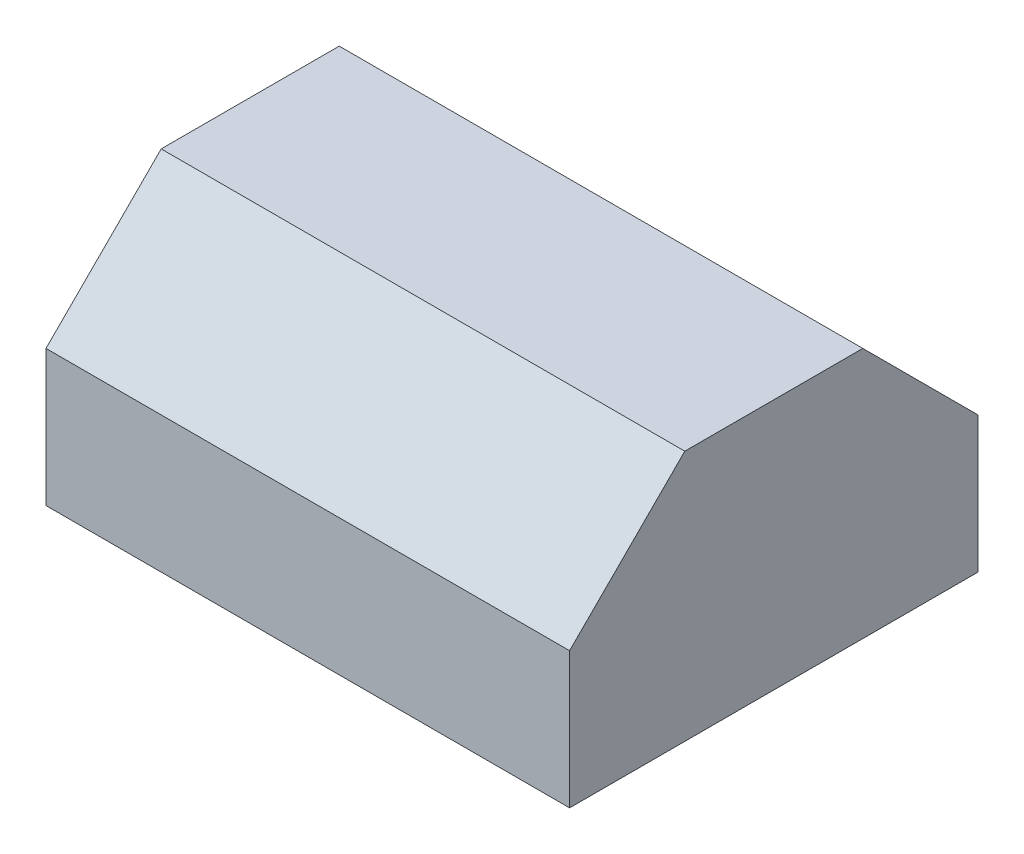
ISO-10303-21;
HEADER;
FILE_DESCRIPTION(('STEP AP214'),'2;1');
FILE_NAME('part.step','',(''),(''),'','','');
FILE_SCHEMA(('AUTOMOTIVE_DESIGN { 1 0 10303 214 1 1 1 1 }'));
ENDSEC;
DATA;
#1=APPLICATION_CONTEXT('core data for automotive mechanical design processes');
#2=APPLICATION_PROTOCOL_DEFINITION('international standard','automotive_design',2000,#1);
#3=PRODUCT_CONTEXT('',#1,'mechanical');
#4=PRODUCT('Part','Part','',(#3));
#5=PRODUCT_RELATED_PRODUCT_CATEGORY('part','',(#4));
#6=PRODUCT_DEFINITION_FORMATION('','',#4);
#7=PRODUCT_DEFINITION_CONTEXT('part definition',#1,'design');
#8=PRODUCT_DEFINITION('design','',#6,#7);
#9=PRODUCT_DEFINITION_SHAPE('','',#8);
#10=(LENGTH_UNIT() NAMED_UNIT(*) SI_UNIT(.MILLI.,.METRE.));
#11=(NAMED_UNIT(*) PLANE_ANGLE_UNIT() SI_UNIT($,.RADIAN.));
#12=(NAMED_UNIT(*) SI_UNIT($,.STERADIAN.) SOLID_ANGLE_UNIT());
#13=UNCERTAINTY_MEASURE_WITH_UNIT(LENGTH_MEASURE(1.E-05),#10,'distance_accuracy_value','');
#14=(GEOMETRIC_REPRESENTATION_CONTEXT(3) GLOBAL_UNCERTAINTY_ASSIGNED_CONTEXT((#13)) GLOBAL_UNIT_ASSIGNED_CONTEXT((#10,
#11,#12)) REPRESENTATION_CONTEXT('',''));
#15=CARTESIAN_POINT('',(0.,0.,0.));
#16=DIRECTION('',(0.,0.,1.));
#17=DIRECTION('',(1.,0.,0.));
#18=AXIS2_PLACEMENT_3D('',#15,#16,#17);
#19=CARTESIAN_POINT('',(250.,0.,0.));
#20=DIRECTION('',(0.,1.,0.));
#21=DIRECTION('',(0.,0.,1.));
#22=AXIS2_PLACEMENT_3D('',#19,#20,#21);
#23=PLANE('',#22);
#24=DIRECTION('',(0.,0.,-1.));
#25=VECTOR('',#24,1.);
#26=CARTESIAN_POINT('',(230.,0.,-195.));
#27=LINE('',#26,#25);
#28=CARTESIAN_POINT('',(230.,0.,-190.));
#29=VERTEX_POINT('',#28);
#30=CARTESIAN_POINT('',(230.,0.,-195.));
#31=VERTEX_POINT('',#30);
#32=EDGE_CURVE('E201',#29,#31,#27,.T.);
#33=ORIENTED_EDGE('',*,*,#32,.F.);
#34=DIRECTION('',(-1.,0.,0.));
#35=VECTOR('',#34,1.);
#36=CARTESIAN_POINT('',(250.,0.,-190.));
#37=LINE('',#36,#35);
#38=CARTESIAN_POINT('',(20.,0.,-190.));
#39=VERTEX_POINT('',#38);
#40=EDGE_CURVE('E210',#29,#39,#37,.T.);
#41=ORIENTED_EDGE('',*,*,#40,.T.);
#42=DIRECTION('',(0.,0.,1.));
#43=VECTOR('',#42,1.);
#44=CARTESIAN_POINT('',(20.,0.,-195.));
#45=LINE('',#44,#43);
#46=CARTESIAN_POINT('',(20.,0.,-195.));
#47=VERTEX_POINT('',#46);
#48=EDGE_CURVE('E244',#47,#39,#45,.T.);
#49=ORIENTED_EDGE('',*,*,#48,.F.);
#50=DIRECTION('',(-1.,0.,0.));
#51=VECTOR('',#50,1.);
#52=CARTESIAN_POINT('',(250.,0.,-195.));
#53=LINE('',#52,#51);
#54=EDGE_CURVE('E221',#31,#47,#53,.T.);
#55=ORIENTED_EDGE('',*,*,#54,.F.);
#56=EDGE_LOOP('',(#33,#41,#49,#55));
#57=FACE_BOUND('',#56,.T.);
#58=ADVANCED_FACE('F35',(#57),#23,.F.);
#59=DIRECTION('',(0.,0.,1.));
#60=VECTOR('',#59,1.);
#61=CARTESIAN_POINT('',(240.,0.,-195.));
#62=LINE('',#61,#60);
#63=CARTESIAN_POINT('',(240.,0.,-195.));
#64=VERTEX_POINT('',#63);
#65=CARTESIAN_POINT('',(240.,0.,-190.));
#66=VERTEX_POINT('',#65);
#67=EDGE_CURVE('E222',#64,#66,#62,.T.);
#68=ORIENTED_EDGE('',*,*,#67,.F.);
#69=CARTESIAN_POINT('',(250.,0.,-195.));
#70=VERTEX_POINT('',#69);
#71=EDGE_CURVE('E385',#70,#64,#53,.T.);
#72=ORIENTED_EDGE('',*,*,#71,.F.);
#73=DIRECTION('',(0.,0.,-1.));
#74=VECTOR('',#73,1.);
#75=CARTESIAN_POINT('',(250.,0.,0.));
#76=LINE('',#75,#74);
#77=CARTESIAN_POINT('',(250.,0.,0.));
#78=VERTEX_POINT('',#77);
#79=EDGE_CURVE('E346',#78,#70,#76,.T.);
#80=ORIENTED_EDGE('',*,*,#79,.F.);
#81=DIRECTION('',(-1.,0.,0.));
#82=VECTOR('',#81,1.);
#83=CARTESIAN_POINT('',(250.,0.,0.));
#84=LINE('',#83,#82);
#85=CARTESIAN_POINT('',(0.,0.,0.));
#86=VERTEX_POINT('',#85);
#87=EDGE_CURVE('E380',#78,#86,#84,.T.);
#88=ORIENTED_EDGE('',*,*,#87,.T.);
#89=DIRECTION('',(0.,0.,-1.));
#90=VECTOR('',#89,1.);
#91=CARTESIAN_POINT('',(0.,0.,0.));
#92=LINE('',#91,#90);
#93=CARTESIAN_POINT('',(0.,0.,-195.));
#94=VERTEX_POINT('',#93);
#95=EDGE_CURVE('E361',#86,#94,#92,.T.);
#96=ORIENTED_EDGE('',*,*,#95,.T.);
#97=CARTESIAN_POINT('',(10.,0.,-195.));
#98=VERTEX_POINT('',#97);
#99=EDGE_CURVE('E377',#98,#94,#53,.T.);
#100=ORIENTED_EDGE('',*,*,#99,.F.);
#101=DIRECTION('',(0.,0.,-1.));
#102=VECTOR('',#101,1.);
#103=CARTESIAN_POINT('',(10.,0.,-195.));
#104=LINE('',#103,#102);
#105=CARTESIAN_POINT('',(10.,0.,-190.));
#106=VERTEX_POINT('',#105);
#107=EDGE_CURVE('E239',#106,#98,#104,.T.);
#108=ORIENTED_EDGE('',*,*,#107,.F.);
#109=CARTESIAN_POINT('',(5.,0.,-190.));
#110=VERTEX_POINT('',#109);
#111=EDGE_CURVE('E217',#106,#110,#37,.T.);
#112=ORIENTED_EDGE('',*,*,#111,.T.);
#113=DIRECTION('',(0.,0.,-1.));
#114=VECTOR('',#113,1.);
#115=CARTESIAN_POINT('',(5.,0.,0.));
#116=LINE('',#115,#114);
#117=CARTESIAN_POINT('',(5.,0.,-5.));
#118=VERTEX_POINT('',#117);
#119=EDGE_CURVE('E331',#118,#110,#116,.T.);
#120=ORIENTED_EDGE('',*,*,#119,.F.);
#121=DIRECTION('',(-1.,0.,0.));
#122=VECTOR('',#121,1.);
#123=CARTESIAN_POINT('',(250.,0.,-5.));
#124=LINE('',#123,#122);
#125=CARTESIAN_POINT('',(245.,0.,-5.));
#126=VERTEX_POINT('',#125);
#127=EDGE_CURVE('E722',#126,#118,#124,.T.);
#128=ORIENTED_EDGE('',*,*,#127,.F.);
#129=DIRECTION('',(0.,0.,-1.));
#130=VECTOR('',#129,1.);
#131=CARTESIAN_POINT('',(245.,0.,0.));
#132=LINE('',#131,#130);
#133=CARTESIAN_POINT('',(245.,0.,-190.));
#134=VERTEX_POINT('',#133);
#135=EDGE_CURVE('E333',#126,#134,#132,.T.);
#136=ORIENTED_EDGE('',*,*,#135,.T.);
#137=EDGE_CURVE('E216',#134,#66,#37,.T.);
#138=ORIENTED_EDGE('',*,*,#137,.T.);
#139=EDGE_LOOP('',(#68,#72,#80,#88,#96,#100,#108,#112,#120,#128,#136,#138));
#140=FACE_BOUND('',#139,.T.);
#141=ADVANCED_FACE('F400',(#140),#23,.F.);
#142=CARTESIAN_POINT('',(250.,32.5000000000002,32.5));
#143=DIRECTION('',(0.,-0.70710678118655,-0.707106781186545));
#144=DIRECTION('',(0.,0.707106781186545,-0.70710678118655));
#145=AXIS2_PLACEMENT_3D('',#142,#143,#144);
#146=PLANE('',#145);
#147=DIRECTION('',(0.,-0.707106781186545,0.70710678118655));
#148=VECTOR('',#147,1.);
#149=CARTESIAN_POINT('',(0.,32.5000000000002,32.5));
#150=LINE('',#149,#148);
#151=CARTESIAN_POINT('',(0.,120.,-55.0000000000001));
#152=VERTEX_POINT('',#151);
#153=CARTESIAN_POINT('',(0.,65.,0.));
#154=VERTEX_POINT('',#153);
#155=EDGE_CURVE('E355',#152,#154,#150,.T.);
#156=ORIENTED_EDGE('',*,*,#155,.T.);
#157=DIRECTION('',(-1.,0.,0.));
#158=VECTOR('',#157,1.);
#159=CARTESIAN_POINT('',(250.,65.,0.));
#160=LINE('',#159,#158);
#161=CARTESIAN_POINT('',(250.,65.,0.));
#162=VERTEX_POINT('',#161);
#163=EDGE_CURVE('E387',#162,#154,#160,.T.);
#164=ORIENTED_EDGE('',*,*,#163,.F.);
#165=DIRECTION('',(0.,-0.707106781186545,0.70710678118655));
#166=VECTOR('',#165,1.);
#167=CARTESIAN_POINT('',(250.,32.5000000000002,32.5));
#168=LINE('',#167,#166);
#169=CARTESIAN_POINT('',(250.,120.,-55.0000000000001));
#170=VERTEX_POINT('',#169);
#171=EDGE_CURVE('E340',#170,#162,#168,.T.);
#172=ORIENTED_EDGE('',*,*,#171,.F.);
#173=DIRECTION('',(-1.,0.,0.));
#174=VECTOR('',#173,1.);
#175=CARTESIAN_POINT('',(250.,120.,-55.0000000000001));
#176=LINE('',#175,#174);
#177=EDGE_CURVE('E354',#170,#152,#176,.T.);
#178=ORIENTED_EDGE('',*,*,#177,.T.);
#179=EDGE_LOOP('',(#156,#164,#172,#178));
#180=FACE_BOUND('',#179,.T.);
#181=ADVANCED_FACE('F454',(#180),#146,.F.);
#182=CARTESIAN_POINT('',(250.,0.,0.));
#183=DIRECTION('',(0.,0.,-1.));
#184=DIRECTION('',(0.,1.,0.));
#185=AXIS2_PLACEMENT_3D('',#182,#183,#184);
#186=PLANE('',#185);
#187=DIRECTION('',(0.,-1.,0.));
#188=VECTOR('',#187,1.);
#189=CARTESIAN_POINT('',(0.,0.,0.));
#190=LINE('',#189,#188);
#191=EDGE_CURVE('E358',#154,#86,#190,.T.);
#192=ORIENTED_EDGE('',*,*,#191,.T.);
#193=ORIENTED_EDGE('',*,*,#87,.F.);
#194=DIRECTION('',(0.,-1.,0.));
#195=VECTOR('',#194,1.);
#196=CARTESIAN_POINT('',(250.,0.,0.));
#197=LINE('',#196,#195);
#198=EDGE_CURVE('E343',#162,#78,#197,.T.);
#199=ORIENTED_EDGE('',*,*,#198,.F.);
#200=ORIENTED_EDGE('',*,*,#163,.T.);
#201=EDGE_LOOP('',(#192,#193,#199,#200));
#202=FACE_BOUND('',#201,.T.);
#203=ADVANCED_FACE('F458',(#202),#186,.F.);
#204=CARTESIAN_POINT('',(250.,0.,-195.));
#205=DIRECTION('',(0.,0.,1.));
#206=DIRECTION('',(1.,0.,0.));
#207=AXIS2_PLACEMENT_3D('',#204,#205,#206);
#208=PLANE('',#207);
#209=DIRECTION('',(0.,1.,0.));
#210=VECTOR('',#209,1.);
#211=CARTESIAN_POINT('',(240.,-5.,-195.));
#212=LINE('',#211,#210);
#213=CARTESIAN_POINT('',(240.,-3.,-195.));
#214=VERTEX_POINT('',#213);
#215=EDGE_CURVE('E235',#214,#64,#212,.T.);
#216=ORIENTED_EDGE('',*,*,#215,.F.);
#217=DIRECTION('',(1.,0.,0.));
#218=VECTOR('',#217,1.);
#219=CARTESIAN_POINT('',(250.,-3.,-195.));
#220=LINE('',#219,#218);
#221=CARTESIAN_POINT('',(230.,-3.,-195.));
#222=VERTEX_POINT('',#221);
#223=EDGE_CURVE('E284',#214,#222,#220,.F.);
#224=ORIENTED_EDGE('',*,*,#223,.T.);
#225=DIRECTION('',(0.,1.,0.));
#226=VECTOR('',#225,1.);
#227=CARTESIAN_POINT('',(230.,-5.,-195.));
#228=LINE('',#227,#226);
#229=EDGE_CURVE('E237',#222,#31,#228,.T.);
#230=ORIENTED_EDGE('',*,*,#229,.T.);
#231=ORIENTED_EDGE('',*,*,#54,.T.);
#232=DIRECTION('',(0.,1.,0.));
#233=VECTOR('',#232,1.);
#234=CARTESIAN_POINT('',(20.,-5.,-195.));
#235=LINE('',#234,#233);
#236=CARTESIAN_POINT('',(20.,-3.,-195.));
#237=VERTEX_POINT('',#236);
#238=EDGE_CURVE('E267',#237,#47,#235,.T.);
#239=ORIENTED_EDGE('',*,*,#238,.F.);
#240=DIRECTION('',(1.,0.,0.));
#241=VECTOR('',#240,1.);
#242=CARTESIAN_POINT('',(250.,-3.,-195.));
#243=LINE('',#242,#241);
#244=CARTESIAN_POINT('',(10.,-3.,-195.));
#245=VERTEX_POINT('',#244);
#246=EDGE_CURVE('E282',#237,#245,#243,.F.);
#247=ORIENTED_EDGE('',*,*,#246,.T.);
#248=DIRECTION('',(0.,1.,0.));
#249=VECTOR('',#248,1.);
#250=CARTESIAN_POINT('',(10.,-5.,-195.));
#251=LINE('',#250,#249);
#252=EDGE_CURVE('E277',#245,#98,#251,.T.);
#253=ORIENTED_EDGE('',*,*,#252,.T.);
#254=ORIENTED_EDGE('',*,*,#99,.T.);
#255=DIRECTION('',(0.,1.,0.));
#256=VECTOR('',#255,1.);
#257=CARTESIAN_POINT('',(0.,0.,-195.));
#258=LINE('',#257,#256);
#259=CARTESIAN_POINT('',(0.,65.,-195.));
#260=VERTEX_POINT('',#259);
#261=EDGE_CURVE('E364',#94,#260,#258,.T.);
#262=ORIENTED_EDGE('',*,*,#261,.T.);
#263=DIRECTION('',(-1.,0.,0.));
#264=VECTOR('',#263,1.);
#265=CARTESIAN_POINT('',(250.,65.,-195.));
#266=LINE('',#265,#264);
#267=CARTESIAN_POINT('',(250.,65.,-195.));
#268=VERTEX_POINT('',#267);
#269=EDGE_CURVE('E374',#268,#260,#266,.T.);
#270=ORIENTED_EDGE('',*,*,#269,.F.);
#271=DIRECTION('',(0.,1.,0.));
#272=VECTOR('',#271,1.);
#273=CARTESIAN_POINT('',(250.,0.,-195.));
#274=LINE('',#273,#272);
#275=EDGE_CURVE('E348',#70,#268,#274,.T.);
#276=ORIENTED_EDGE('',*,*,#275,.F.);
#277=ORIENTED_EDGE('',*,*,#71,.T.);
#278=EDGE_LOOP('',(#216,#224,#230,#231,#239,#247,#253,#254,#262,#270,#276,#277));
#279=FACE_BOUND('',#278,.T.);
#280=ADVANCED_FACE('F304',(#279),#208,.F.);
#281=CARTESIAN_POINT('',(250.,130.,-130.));
#282=DIRECTION('',(0.,-0.707106781186549,0.707106781186546));
#283=DIRECTION('',(0.,-0.707106781186546,-0.707106781186549));
#284=AXIS2_PLACEMENT_3D('',#281,#282,#283);
#285=PLANE('',#284);
#286=DIRECTION('',(0.,0.707106781186546,0.707106781186549));
#287=VECTOR('',#286,1.);
#288=CARTESIAN_POINT('',(0.,130.,-130.));
#289=LINE('',#288,#287);
#290=CARTESIAN_POINT('',(0.,120.,-140.));
#291=VERTEX_POINT('',#290);
#292=EDGE_CURVE('E366',#260,#291,#289,.T.);
#293=ORIENTED_EDGE('',*,*,#292,.T.);
#294=DIRECTION('',(-1.,0.,0.));
#295=VECTOR('',#294,1.);
#296=CARTESIAN_POINT('',(250.,120.,-140.));
#297=LINE('',#296,#295);
#298=CARTESIAN_POINT('',(250.,120.,-140.));
#299=VERTEX_POINT('',#298);
#300=EDGE_CURVE('E371',#299,#291,#297,.T.);
#301=ORIENTED_EDGE('',*,*,#300,.F.);
#302=DIRECTION('',(0.,0.707106781186546,0.707106781186549));
#303=VECTOR('',#302,1.);
#304=CARTESIAN_POINT('',(250.,130.,-130.));
#305=LINE('',#304,#303);
#306=EDGE_CURVE('E350',#268,#299,#305,.T.);
#307=ORIENTED_EDGE('',*,*,#306,.F.);
#308=ORIENTED_EDGE('',*,*,#269,.T.);
#309=EDGE_LOOP('',(#293,#301,#307,#308));
#310=FACE_BOUND('',#309,.T.);
#311=ADVANCED_FACE('F413',(#310),#285,.F.);
#312=CARTESIAN_POINT('',(250.,120.,1.17553026136781E-13));
#313=DIRECTION('',(0.,-1.,0.));
#314=DIRECTION('',(0.,0.,-1.));
#315=AXIS2_PLACEMENT_3D('',#312,#313,#314);
#316=PLANE('',#315);
#317=DIRECTION('',(0.,0.,1.));
#318=VECTOR('',#317,1.);
#319=CARTESIAN_POINT('',(0.,120.,1.17553026136781E-13));
#320=LINE('',#319,#318);
#321=EDGE_CURVE('E344',#291,#152,#320,.T.);
#322=ORIENTED_EDGE('',*,*,#321,.T.);
#323=ORIENTED_EDGE('',*,*,#177,.F.);
#324=DIRECTION('',(0.,0.,1.));
#325=VECTOR('',#324,1.);
#326=CARTESIAN_POINT('',(250.,120.,1.17553026136781E-13));
#327=LINE('',#326,#325);
#328=EDGE_CURVE('E352',#299,#170,#327,.T.);
#329=ORIENTED_EDGE('',*,*,#328,.F.);
#330=ORIENTED_EDGE('',*,*,#300,.T.);
#331=EDGE_LOOP('',(#322,#323,#329,#330));
#332=FACE_BOUND('',#331,.T.);
#333=ADVANCED_FACE('F466',(#332),#316,.F.);
#334=CARTESIAN_POINT('',(250.,0.,0.));
#335=DIRECTION('',(1.,0.,0.));
#336=DIRECTION('',(0.,0.,-1.));
#337=AXIS2_PLACEMENT_3D('',#334,#335,#336);
#338=PLANE('',#337);
#339=ORIENTED_EDGE('',*,*,#171,.T.);
#340=ORIENTED_EDGE('',*,*,#198,.T.);
#341=ORIENTED_EDGE('',*,*,#79,.T.);
#342=ORIENTED_EDGE('',*,*,#275,.T.);
#343=ORIENTED_EDGE('',*,*,#306,.T.);
#344=ORIENTED_EDGE('',*,*,#328,.T.);
#345=EDGE_LOOP('',(#339,#340,#341,#342,#343,#344));
#346=FACE_BOUND('',#345,.T.);
#347=ADVANCED_FACE('F417',(#346),#338,.T.);
#348=CARTESIAN_POINT('',(0.,0.,0.));
#349=DIRECTION('',(1.,0.,0.));
#350=DIRECTION('',(0.,0.,-1.));
#351=AXIS2_PLACEMENT_3D('',#348,#349,#350);
#352=PLANE('',#351);
#353=ORIENTED_EDGE('',*,*,#155,.F.);
#354=ORIENTED_EDGE('',*,*,#321,.F.);
#355=ORIENTED_EDGE('',*,*,#292,.F.);
#356=ORIENTED_EDGE('',*,*,#261,.F.);
#357=ORIENTED_EDGE('',*,*,#95,.F.);
#358=ORIENTED_EDGE('',*,*,#191,.F.);
#359=EDGE_LOOP('',(#353,#354,#355,#356,#357,#358));
#360=FACE_BOUND('',#359,.T.);
#361=ADVANCED_FACE('F406',(#360),#352,.F.);
#362=CARTESIAN_POINT('',(250.,28.9644660940675,28.9644660940673));
#363=DIRECTION('',(0.,-0.70710678118655,-0.707106781186545));
#364=DIRECTION('',(0.,0.707106781186545,-0.70710678118655));
#365=AXIS2_PLACEMENT_3D('',#362,#363,#364);
#366=PLANE('',#365);
#367=DIRECTION('',(0.,-0.707106781186545,0.70710678118655));
#368=VECTOR('',#367,1.);
#369=CARTESIAN_POINT('',(5.,28.9644660940675,28.9644660940673));
#370=LINE('',#369,#368);
#371=CARTESIAN_POINT('',(5.,115.,-57.0710678118655));
#372=VERTEX_POINT('',#371);
#373=CARTESIAN_POINT('',(5.,62.9289321881345,-5.));
#374=VERTEX_POINT('',#373);
#375=EDGE_CURVE('E281',#372,#374,#370,.T.);
#376=ORIENTED_EDGE('',*,*,#375,.F.);
#377=DIRECTION('',(-1.,0.,0.));
#378=VECTOR('',#377,1.);
#379=CARTESIAN_POINT('',(250.,115.,-57.0710678118655));
#380=LINE('',#379,#378);
#381=CARTESIAN_POINT('',(245.,115.,-57.0710678118655));
#382=VERTEX_POINT('',#381);
#383=EDGE_CURVE('E715',#382,#372,#380,.T.);
#384=ORIENTED_EDGE('',*,*,#383,.F.);
#385=DIRECTION('',(0.,-0.707106781186545,0.70710678118655));
#386=VECTOR('',#385,1.);
#387=CARTESIAN_POINT('',(245.,28.9644660940675,28.9644660940673));
#388=LINE('',#387,#386);
#389=CARTESIAN_POINT('',(245.,62.9289321881345,-5.));
#390=VERTEX_POINT('',#389);
#391=EDGE_CURVE('E723',#382,#390,#388,.T.);
#392=ORIENTED_EDGE('',*,*,#391,.T.);
#393=DIRECTION('',(-1.,0.,0.));
#394=VECTOR('',#393,1.);
#395=CARTESIAN_POINT('',(250.,62.9289321881345,-5.));
#396=LINE('',#395,#394);
#397=EDGE_CURVE('E359',#390,#374,#396,.T.);
#398=ORIENTED_EDGE('',*,*,#397,.T.);
#399=EDGE_LOOP('',(#376,#384,#392,#398));
#400=FACE_BOUND('',#399,.T.);
#401=ADVANCED_FACE('F476',(#400),#366,.T.);
#402=CARTESIAN_POINT('',(250.,0.,-5.));
#403=DIRECTION('',(0.,0.,-1.));
#404=DIRECTION('',(0.,1.,0.));
#405=AXIS2_PLACEMENT_3D('',#402,#403,#404);
#406=PLANE('',#405);
#407=DIRECTION('',(0.,-1.,0.));
#408=VECTOR('',#407,1.);
#409=CARTESIAN_POINT('',(5.,0.,-5.));
#410=LINE('',#409,#408);
#411=EDGE_CURVE('E718',#374,#118,#410,.T.);
#412=ORIENTED_EDGE('',*,*,#411,.F.);
#413=ORIENTED_EDGE('',*,*,#397,.F.);
#414=DIRECTION('',(0.,-1.,0.));
#415=VECTOR('',#414,1.);
#416=CARTESIAN_POINT('',(245.,0.,-5.));
#417=LINE('',#416,#415);
#418=EDGE_CURVE('E339',#390,#126,#417,.T.);
#419=ORIENTED_EDGE('',*,*,#418,.T.);
#420=ORIENTED_EDGE('',*,*,#127,.T.);
#421=EDGE_LOOP('',(#412,#413,#419,#420));
#422=FACE_BOUND('',#421,.T.);
#423=ADVANCED_FACE('F496',(#422),#406,.T.);
#424=CARTESIAN_POINT('',(250.,0.,-190.));
#425=DIRECTION('',(0.,0.,1.));
#426=DIRECTION('',(1.,0.,0.));
#427=AXIS2_PLACEMENT_3D('',#424,#425,#426);
#428=PLANE('',#427);
#429=DIRECTION('',(0.,1.,0.));
#430=VECTOR('',#429,1.);
#431=CARTESIAN_POINT('',(230.,-5.,-190.));
#432=LINE('',#431,#430);
#433=CARTESIAN_POINT('',(230.,-3.,-190.));
#434=VERTEX_POINT('',#433);
#435=EDGE_CURVE('E196',#434,#29,#432,.T.);
#436=ORIENTED_EDGE('',*,*,#435,.F.);
#437=DIRECTION('',(-1.,0.,0.));
#438=VECTOR('',#437,1.);
#439=CARTESIAN_POINT('',(240.,-3.,-190.));
#440=LINE('',#439,#438);
#441=CARTESIAN_POINT('',(240.,-3.,-190.));
#442=VERTEX_POINT('',#441);
#443=EDGE_CURVE('E287',#434,#442,#440,.F.);
#444=ORIENTED_EDGE('',*,*,#443,.T.);
#445=DIRECTION('',(0.,1.,0.));
#446=VECTOR('',#445,1.);
#447=CARTESIAN_POINT('',(240.,-5.,-190.));
#448=LINE('',#447,#446);
#449=EDGE_CURVE('E206',#442,#66,#448,.T.);
#450=ORIENTED_EDGE('',*,*,#449,.T.);
#451=ORIENTED_EDGE('',*,*,#137,.F.);
#452=DIRECTION('',(0.,1.,0.));
#453=VECTOR('',#452,1.);
#454=CARTESIAN_POINT('',(245.,0.,-190.));
#455=LINE('',#454,#453);
#456=CARTESIAN_POINT('',(245.,62.9289321881346,-190.));
#457=VERTEX_POINT('',#456);
#458=EDGE_CURVE('E338',#134,#457,#455,.T.);
#459=ORIENTED_EDGE('',*,*,#458,.T.);
#460=DIRECTION('',(-1.,0.,0.));
#461=VECTOR('',#460,1.);
#462=CARTESIAN_POINT('',(250.,62.9289321881346,-190.));
#463=LINE('',#462,#461);
#464=CARTESIAN_POINT('',(5.,62.9289321881346,-190.));
#465=VERTEX_POINT('',#464);
#466=EDGE_CURVE('E323',#457,#465,#463,.T.);
#467=ORIENTED_EDGE('',*,*,#466,.T.);
#468=DIRECTION('',(0.,1.,0.));
#469=VECTOR('',#468,1.);
#470=CARTESIAN_POINT('',(5.,0.,-190.));
#471=LINE('',#470,#469);
#472=EDGE_CURVE('E319',#110,#465,#471,.T.);
#473=ORIENTED_EDGE('',*,*,#472,.F.);
#474=ORIENTED_EDGE('',*,*,#111,.F.);
#475=DIRECTION('',(0.,1.,0.));
#476=VECTOR('',#475,1.);
#477=CARTESIAN_POINT('',(10.,-5.,-190.));
#478=LINE('',#477,#476);
#479=CARTESIAN_POINT('',(10.,-3.,-190.));
#480=VERTEX_POINT('',#479);
#481=EDGE_CURVE('E246',#480,#106,#478,.T.);
#482=ORIENTED_EDGE('',*,*,#481,.F.);
#483=DIRECTION('',(-1.,0.,0.));
#484=VECTOR('',#483,1.);
#485=CARTESIAN_POINT('',(20.,-3.,-190.));
#486=LINE('',#485,#484);
#487=CARTESIAN_POINT('',(20.,-3.,-190.));
#488=VERTEX_POINT('',#487);
#489=EDGE_CURVE('E268',#480,#488,#486,.F.);
#490=ORIENTED_EDGE('',*,*,#489,.T.);
#491=DIRECTION('',(0.,1.,0.));
#492=VECTOR('',#491,1.);
#493=CARTESIAN_POINT('',(20.,-5.,-190.));
#494=LINE('',#493,#492);
#495=EDGE_CURVE('E212',#488,#39,#494,.T.);
#496=ORIENTED_EDGE('',*,*,#495,.T.);
#497=ORIENTED_EDGE('',*,*,#40,.F.);
#498=EDGE_LOOP('',(#436,#444,#450,#451,#459,#467,#473,#474,#482,#490,#496,#497));
#499=FACE_BOUND('',#498,.T.);
#500=ADVANCED_FACE('F211',(#499),#428,.T.);
#501=CARTESIAN_POINT('',(250.,126.464466094067,-126.464466094067));
#502=DIRECTION('',(0.,-0.707106781186549,0.707106781186546));
#503=DIRECTION('',(0.,-0.707106781186546,-0.707106781186549));
#504=AXIS2_PLACEMENT_3D('',#501,#502,#503);
#505=PLANE('',#504);
#506=DIRECTION('',(0.,0.707106781186546,0.707106781186549));
#507=VECTOR('',#506,1.);
#508=CARTESIAN_POINT('',(5.,126.464466094067,-126.464466094067));
#509=LINE('',#508,#507);
#510=CARTESIAN_POINT('',(5.,115.,-137.928932188135));
#511=VERTEX_POINT('',#510);
#512=EDGE_CURVE('E734',#465,#511,#509,.T.);
#513=ORIENTED_EDGE('',*,*,#512,.F.);
#514=ORIENTED_EDGE('',*,*,#466,.F.);
#515=DIRECTION('',(0.,0.707106781186546,0.707106781186549));
#516=VECTOR('',#515,1.);
#517=CARTESIAN_POINT('',(245.,126.464466094067,-126.464466094067));
#518=LINE('',#517,#516);
#519=CARTESIAN_POINT('',(245.,115.,-137.928932188135));
#520=VERTEX_POINT('',#519);
#521=EDGE_CURVE('E731',#457,#520,#518,.T.);
#522=ORIENTED_EDGE('',*,*,#521,.T.);
#523=DIRECTION('',(-1.,0.,0.));
#524=VECTOR('',#523,1.);
#525=CARTESIAN_POINT('',(250.,115.,-137.928932188135));
#526=LINE('',#525,#524);
#527=EDGE_CURVE('E324',#520,#511,#526,.T.);
#528=ORIENTED_EDGE('',*,*,#527,.T.);
#529=EDGE_LOOP('',(#513,#514,#522,#528));
#530=FACE_BOUND('',#529,.T.);
#531=ADVANCED_FACE('F489',(#530),#505,.T.);
#532=CARTESIAN_POINT('',(250.,115.,1.12654983381082E-13));
#533=DIRECTION('',(0.,-1.,0.));
#534=DIRECTION('',(0.,0.,-1.));
#535=AXIS2_PLACEMENT_3D('',#532,#533,#534);
#536=PLANE('',#535);
#537=DIRECTION('',(0.,0.,1.));
#538=VECTOR('',#537,1.);
#539=CARTESIAN_POINT('',(5.,115.,1.12654983381082E-13));
#540=LINE('',#539,#538);
#541=EDGE_CURVE('E725',#511,#372,#540,.T.);
#542=ORIENTED_EDGE('',*,*,#541,.F.);
#543=ORIENTED_EDGE('',*,*,#527,.F.);
#544=DIRECTION('',(0.,0.,1.));
#545=VECTOR('',#544,1.);
#546=CARTESIAN_POINT('',(245.,115.,1.12654983381082E-13));
#547=LINE('',#546,#545);
#548=EDGE_CURVE('E726',#520,#382,#547,.T.);
#549=ORIENTED_EDGE('',*,*,#548,.T.);
#550=ORIENTED_EDGE('',*,*,#383,.T.);
#551=EDGE_LOOP('',(#542,#543,#549,#550));
#552=FACE_BOUND('',#551,.T.);
#553=ADVANCED_FACE('F485',(#552),#536,.T.);
#554=CARTESIAN_POINT('',(245.,0.,0.));
#555=DIRECTION('',(1.,0.,0.));
#556=DIRECTION('',(0.,0.,-1.));
#557=AXIS2_PLACEMENT_3D('',#554,#555,#556);
#558=PLANE('',#557);
#559=ORIENTED_EDGE('',*,*,#391,.F.);
#560=ORIENTED_EDGE('',*,*,#548,.F.);
#561=ORIENTED_EDGE('',*,*,#521,.F.);
#562=ORIENTED_EDGE('',*,*,#458,.F.);
#563=ORIENTED_EDGE('',*,*,#135,.F.);
#564=ORIENTED_EDGE('',*,*,#418,.F.);
#565=EDGE_LOOP('',(#559,#560,#561,#562,#563,#564));
#566=FACE_BOUND('',#565,.T.);
#567=ADVANCED_FACE('F481',(#566),#558,.F.);
#568=CARTESIAN_POINT('',(5.,0.,0.));
#569=DIRECTION('',(1.,0.,0.));
#570=DIRECTION('',(0.,0.,-1.));
#571=AXIS2_PLACEMENT_3D('',#568,#569,#570);
#572=PLANE('',#571);
#573=ORIENTED_EDGE('',*,*,#375,.T.);
#574=ORIENTED_EDGE('',*,*,#411,.T.);
#575=ORIENTED_EDGE('',*,*,#119,.T.);
#576=ORIENTED_EDGE('',*,*,#472,.T.);
#577=ORIENTED_EDGE('',*,*,#512,.T.);
#578=ORIENTED_EDGE('',*,*,#541,.T.);
#579=EDGE_LOOP('',(#573,#574,#575,#576,#577,#578));
#580=FACE_BOUND('',#579,.T.);
#581=ADVANCED_FACE('F478',(#580),#572,.T.);
#582=CARTESIAN_POINT('',(10.,-5.,-195.));
#583=DIRECTION('',(1.,0.,0.));
#584=DIRECTION('',(0.,0.,-1.));
#585=AXIS2_PLACEMENT_3D('',#582,#583,#584);
#586=PLANE('',#585);
#587=CARTESIAN_POINT('',(10.,-2.5,-192.5));
#588=DIRECTION('',(1.,0.,0.));
#589=DIRECTION('',(0.,0.,-1.));
#590=AXIS2_PLACEMENT_3D('',#587,#588,#589);
#591=CIRCLE('',#590,1.25000000000001);
#592=CARTESIAN_POINT('',(10.,-2.5,-193.75));
#593=VERTEX_POINT('',#592);
#594=EDGE_CURVE('E223',#593,#593,#591,.T.);
#595=ORIENTED_EDGE('',*,*,#594,.T.);
#596=EDGE_LOOP('',(#595));
#597=FACE_BOUND('',#596,.T.);
#598=DIRECTION('',(0.,0.,-1.));
#599=VECTOR('',#598,1.);
#600=CARTESIAN_POINT('',(10.,-5.,-195.));
#601=LINE('',#600,#599);
#602=CARTESIAN_POINT('',(10.,-5.,-192.));
#603=VERTEX_POINT('',#602);
#604=CARTESIAN_POINT('',(10.,-5.,-193.));
#605=VERTEX_POINT('',#604);
#606=EDGE_CURVE('E240',#603,#605,#601,.T.);
#607=ORIENTED_EDGE('',*,*,#606,.F.);
#608=CARTESIAN_POINT('',(10.,-3.,-192.));
#609=DIRECTION('',(1.,0.,0.));
#610=DIRECTION('',(0.,0.,-1.));
#611=AXIS2_PLACEMENT_3D('',#608,#609,#610);
#612=CIRCLE('',#611,2.);
#613=EDGE_CURVE('E299',#603,#480,#612,.F.);
#614=ORIENTED_EDGE('',*,*,#613,.T.);
#615=ORIENTED_EDGE('',*,*,#481,.T.);
#616=ORIENTED_EDGE('',*,*,#107,.T.);
#617=ORIENTED_EDGE('',*,*,#252,.F.);
#618=CARTESIAN_POINT('',(10.,-3.,-193.));
#619=DIRECTION('',(1.,0.,0.));
#620=DIRECTION('',(0.,0.,-1.));
#621=AXIS2_PLACEMENT_3D('',#618,#619,#620);
#622=CIRCLE('',#621,2.);
#623=EDGE_CURVE('E297',#245,#605,#622,.F.);
#624=ORIENTED_EDGE('',*,*,#623,.T.);
#625=EDGE_LOOP('',(#607,#614,#615,#616,#617,#624));
#626=FACE_BOUND('',#625,.T.);
#627=ADVANCED_FACE('F309',(#597,#626),#586,.F.);
#628=CARTESIAN_POINT('',(20.,-5.,-195.));
#629=DIRECTION('',(-1.,0.,0.));
#630=DIRECTION('',(0.,0.,1.));
#631=AXIS2_PLACEMENT_3D('',#628,#629,#630);
#632=PLANE('',#631);
#633=CARTESIAN_POINT('',(20.,-2.5,-192.5));
#634=DIRECTION('',(-1.,0.,0.));
#635=DIRECTION('',(0.,0.,1.));
#636=AXIS2_PLACEMENT_3D('',#633,#634,#635);
#637=CIRCLE('',#636,1.25000000000001);
#638=CARTESIAN_POINT('',(20.,-2.5,-191.25));
#639=VERTEX_POINT('',#638);
#640=EDGE_CURVE('E229',#639,#639,#637,.T.);
#641=ORIENTED_EDGE('',*,*,#640,.T.);
#642=EDGE_LOOP('',(#641));
#643=FACE_BOUND('',#642,.T.);
#644=ORIENTED_EDGE('',*,*,#495,.F.);
#645=CARTESIAN_POINT('',(20.,-3.,-192.));
#646=DIRECTION('',(-1.,0.,0.));
#647=DIRECTION('',(0.,0.,1.));
#648=AXIS2_PLACEMENT_3D('',#645,#646,#647);
#649=CIRCLE('',#648,2.);
#650=CARTESIAN_POINT('',(20.,-5.,-192.));
#651=VERTEX_POINT('',#650);
#652=EDGE_CURVE('E11',#488,#651,#649,.F.);
#653=ORIENTED_EDGE('',*,*,#652,.T.);
#654=DIRECTION('',(0.,0.,1.));
#655=VECTOR('',#654,1.);
#656=CARTESIAN_POINT('',(20.,-5.,-195.));
#657=LINE('',#656,#655);
#658=CARTESIAN_POINT('',(20.,-5.,-193.));
#659=VERTEX_POINT('',#658);
#660=EDGE_CURVE('E243',#659,#651,#657,.T.);
#661=ORIENTED_EDGE('',*,*,#660,.F.);
#662=CARTESIAN_POINT('',(20.,-3.,-193.));
#663=DIRECTION('',(-1.,0.,0.));
#664=DIRECTION('',(0.,0.,1.));
#665=AXIS2_PLACEMENT_3D('',#662,#663,#664);
#666=CIRCLE('',#665,2.);
#667=EDGE_CURVE('E43',#659,#237,#666,.F.);
#668=ORIENTED_EDGE('',*,*,#667,.T.);
#669=ORIENTED_EDGE('',*,*,#238,.T.);
#670=ORIENTED_EDGE('',*,*,#48,.T.);
#671=EDGE_LOOP('',(#644,#653,#661,#668,#669,#670));
#672=FACE_BOUND('',#671,.T.);
#673=ADVANCED_FACE('F301',(#643,#672),#632,.F.);
#674=CARTESIAN_POINT('',(0.,-5.,0.));
#675=DIRECTION('',(0.,1.,0.));
#676=DIRECTION('',(0.,0.,1.));
#677=AXIS2_PLACEMENT_3D('',#674,#675,#676);
#678=PLANE('',#677);
#679=ORIENTED_EDGE('',*,*,#660,.T.);
#680=DIRECTION('',(-1.,0.,0.));
#681=VECTOR('',#680,1.);
#682=CARTESIAN_POINT('',(10.,-5.,-192.));
#683=LINE('',#682,#681);
#684=EDGE_CURVE('E292',#651,#603,#683,.T.);
#685=ORIENTED_EDGE('',*,*,#684,.T.);
#686=ORIENTED_EDGE('',*,*,#606,.T.);
#687=DIRECTION('',(1.,0.,0.));
#688=VECTOR('',#687,1.);
#689=CARTESIAN_POINT('',(0.,-5.,-193.));
#690=LINE('',#689,#688);
#691=EDGE_CURVE('E290',#605,#659,#690,.T.);
#692=ORIENTED_EDGE('',*,*,#691,.T.);
#693=EDGE_LOOP('',(#679,#685,#686,#692));
#694=FACE_BOUND('',#693,.T.);
#695=ADVANCED_FACE('F311',(#694),#678,.F.);
#696=CARTESIAN_POINT('',(230.,-5.,-195.));
#697=DIRECTION('',(1.,0.,0.));
#698=DIRECTION('',(0.,0.,-1.));
#699=AXIS2_PLACEMENT_3D('',#696,#697,#698);
#700=PLANE('',#699);
#701=CARTESIAN_POINT('',(230.,-2.5,-192.5));
#702=DIRECTION('',(1.,0.,0.));
#703=DIRECTION('',(0.,0.,-1.));
#704=AXIS2_PLACEMENT_3D('',#701,#702,#703);
#705=CIRCLE('',#704,1.25000000000001);
#706=CARTESIAN_POINT('',(230.,-2.5,-193.75));
#707=VERTEX_POINT('',#706);
#708=EDGE_CURVE('E530',#707,#707,#705,.T.);
#709=ORIENTED_EDGE('',*,*,#708,.T.);
#710=EDGE_LOOP('',(#709));
#711=FACE_BOUND('',#710,.T.);
#712=ORIENTED_EDGE('',*,*,#229,.F.);
#713=CARTESIAN_POINT('',(230.,-3.,-193.));
#714=DIRECTION('',(1.,0.,0.));
#715=DIRECTION('',(0.,0.,-1.));
#716=AXIS2_PLACEMENT_3D('',#713,#714,#715);
#717=CIRCLE('',#716,2.);
#718=CARTESIAN_POINT('',(230.,-5.,-193.));
#719=VERTEX_POINT('',#718);
#720=EDGE_CURVE('E263',#222,#719,#717,.F.);
#721=ORIENTED_EDGE('',*,*,#720,.T.);
#722=DIRECTION('',(0.,0.,-1.));
#723=VECTOR('',#722,1.);
#724=CARTESIAN_POINT('',(230.,-5.,-195.));
#725=LINE('',#724,#723);
#726=CARTESIAN_POINT('',(230.,-5.,-192.));
#727=VERTEX_POINT('',#726);
#728=EDGE_CURVE('E226',#727,#719,#725,.T.);
#729=ORIENTED_EDGE('',*,*,#728,.F.);
#730=CARTESIAN_POINT('',(230.,-3.,-192.));
#731=DIRECTION('',(1.,0.,0.));
#732=DIRECTION('',(0.,0.,-1.));
#733=AXIS2_PLACEMENT_3D('',#730,#731,#732);
#734=CIRCLE('',#733,2.);
#735=EDGE_CURVE('E203',#727,#434,#734,.F.);
#736=ORIENTED_EDGE('',*,*,#735,.T.);
#737=ORIENTED_EDGE('',*,*,#435,.T.);
#738=ORIENTED_EDGE('',*,*,#32,.T.);
#739=EDGE_LOOP('',(#712,#721,#729,#736,#737,#738));
#740=FACE_BOUND('',#739,.T.);
#741=ADVANCED_FACE('F199',(#711,#740),#700,.F.);
#742=CARTESIAN_POINT('',(240.,-5.,-195.));
#743=DIRECTION('',(-1.,0.,0.));
#744=DIRECTION('',(0.,0.,1.));
#745=AXIS2_PLACEMENT_3D('',#742,#743,#744);
#746=PLANE('',#745);
#747=CARTESIAN_POINT('',(240.,-2.5,-192.5));
#748=DIRECTION('',(1.,0.,0.));
#749=DIRECTION('',(0.,0.,-1.));
#750=AXIS2_PLACEMENT_3D('',#747,#748,#749);
#751=CIRCLE('',#750,1.25000000000001);
#752=CARTESIAN_POINT('',(240.,-2.5,-193.75));
#753=VERTEX_POINT('',#752);
#754=EDGE_CURVE('E527',#753,#753,#751,.T.);
#755=ORIENTED_EDGE('',*,*,#754,.F.);
#756=EDGE_LOOP('',(#755));
#757=FACE_BOUND('',#756,.T.);
#758=DIRECTION('',(0.,0.,1.));
#759=VECTOR('',#758,1.);
#760=CARTESIAN_POINT('',(240.,-5.,-195.));
#761=LINE('',#760,#759);
#762=CARTESIAN_POINT('',(240.,-5.,-193.));
#763=VERTEX_POINT('',#762);
#764=CARTESIAN_POINT('',(240.,-5.,-192.));
#765=VERTEX_POINT('',#764);
#766=EDGE_CURVE('E207',#763,#765,#761,.T.);
#767=ORIENTED_EDGE('',*,*,#766,.F.);
#768=CARTESIAN_POINT('',(240.,-3.,-193.));
#769=DIRECTION('',(-1.,0.,0.));
#770=DIRECTION('',(0.,0.,1.));
#771=AXIS2_PLACEMENT_3D('',#768,#769,#770);
#772=CIRCLE('',#771,2.);
#773=EDGE_CURVE('E278',#763,#214,#772,.F.);
#774=ORIENTED_EDGE('',*,*,#773,.T.);
#775=ORIENTED_EDGE('',*,*,#215,.T.);
#776=ORIENTED_EDGE('',*,*,#67,.T.);
#777=ORIENTED_EDGE('',*,*,#449,.F.);
#778=CARTESIAN_POINT('',(240.,-3.,-192.));
#779=DIRECTION('',(-1.,0.,0.));
#780=DIRECTION('',(0.,0.,1.));
#781=AXIS2_PLACEMENT_3D('',#778,#779,#780);
#782=CIRCLE('',#781,2.);
#783=EDGE_CURVE('E429',#442,#765,#782,.F.);
#784=ORIENTED_EDGE('',*,*,#783,.T.);
#785=EDGE_LOOP('',(#767,#774,#775,#776,#777,#784));
#786=FACE_BOUND('',#785,.T.);
#787=ADVANCED_FACE('F423',(#757,#786),#746,.F.);
#788=CARTESIAN_POINT('',(0.,-5.,0.));
#789=DIRECTION('',(0.,1.,0.));
#790=DIRECTION('',(0.,0.,1.));
#791=AXIS2_PLACEMENT_3D('',#788,#789,#790);
#792=PLANE('',#791);
#793=ORIENTED_EDGE('',*,*,#728,.T.);
#794=DIRECTION('',(1.,0.,0.));
#795=VECTOR('',#794,1.);
#796=CARTESIAN_POINT('',(0.,-5.,-193.));
#797=LINE('',#796,#795);
#798=EDGE_CURVE('E393',#719,#763,#797,.T.);
#799=ORIENTED_EDGE('',*,*,#798,.T.);
#800=ORIENTED_EDGE('',*,*,#766,.T.);
#801=DIRECTION('',(-1.,0.,0.));
#802=VECTOR('',#801,1.);
#803=CARTESIAN_POINT('',(230.,-5.,-192.));
#804=LINE('',#803,#802);
#805=EDGE_CURVE('E389',#765,#727,#804,.T.);
#806=ORIENTED_EDGE('',*,*,#805,.T.);
#807=EDGE_LOOP('',(#793,#799,#800,#806));
#808=FACE_BOUND('',#807,.T.);
#809=ADVANCED_FACE('F432',(#808),#792,.F.);
#810=CARTESIAN_POINT('',(-2.49999999868411E-05,-2.5,-192.5));
#811=DIRECTION('',(1.,0.,0.));
#812=DIRECTION('',(0.,0.,-1.));
#813=AXIS2_PLACEMENT_3D('',#810,#811,#812);
#814=CYLINDRICAL_SURFACE('',#813,1.25000000000001);
#815=ORIENTED_EDGE('',*,*,#754,.T.);
#816=EDGE_LOOP('',(#815));
#817=FACE_BOUND('',#816,.T.);
#818=ORIENTED_EDGE('',*,*,#708,.F.);
#819=EDGE_LOOP('',(#818));
#820=FACE_BOUND('',#819,.T.);
#821=ADVANCED_FACE('F445',(#817,#820),#814,.F.);
#822=ORIENTED_EDGE('',*,*,#640,.F.);
#823=EDGE_LOOP('',(#822));
#824=FACE_BOUND('',#823,.T.);
#825=ORIENTED_EDGE('',*,*,#594,.F.);
#826=EDGE_LOOP('',(#825));
#827=FACE_BOUND('',#826,.T.);
#828=ADVANCED_FACE('F437',(#824,#827),#814,.F.);
#829=CARTESIAN_POINT('',(0.,-3.,-193.));
#830=DIRECTION('',(1.,0.,0.));
#831=DIRECTION('',(0.,0.,-1.));
#832=AXIS2_PLACEMENT_3D('',#829,#830,#831);
#833=CYLINDRICAL_SURFACE('',#832,2.);
#834=ORIENTED_EDGE('',*,*,#720,.F.);
#835=ORIENTED_EDGE('',*,*,#223,.F.);
#836=ORIENTED_EDGE('',*,*,#773,.F.);
#837=ORIENTED_EDGE('',*,*,#798,.F.);
#838=EDGE_LOOP('',(#834,#835,#836,#837));
#839=FACE_BOUND('',#838,.T.);
#840=ADVANCED_FACE('F434',(#839),#833,.T.);
#841=CARTESIAN_POINT('',(0.,-3.,-192.));
#842=DIRECTION('',(1.,0.,0.));
#843=DIRECTION('',(0.,0.,-1.));
#844=AXIS2_PLACEMENT_3D('',#841,#842,#843);
#845=CYLINDRICAL_SURFACE('',#844,2.);
#846=ORIENTED_EDGE('',*,*,#783,.F.);
#847=ORIENTED_EDGE('',*,*,#443,.F.);
#848=ORIENTED_EDGE('',*,*,#735,.F.);
#849=ORIENTED_EDGE('',*,*,#805,.F.);
#850=EDGE_LOOP('',(#846,#847,#848,#849));
#851=FACE_BOUND('',#850,.T.);
#852=ADVANCED_FACE('F436',(#851),#845,.T.);
#853=CARTESIAN_POINT('',(0.,-3.,-192.));
#854=DIRECTION('',(1.,0.,0.));
#855=DIRECTION('',(0.,0.,-1.));
#856=AXIS2_PLACEMENT_3D('',#853,#854,#855);
#857=CYLINDRICAL_SURFACE('',#856,2.);
#858=ORIENTED_EDGE('',*,*,#652,.F.);
#859=ORIENTED_EDGE('',*,*,#489,.F.);
#860=ORIENTED_EDGE('',*,*,#613,.F.);
#861=ORIENTED_EDGE('',*,*,#684,.F.);
#862=EDGE_LOOP('',(#858,#859,#860,#861));
#863=FACE_BOUND('',#862,.T.);
#864=ADVANCED_FACE('F314',(#863),#857,.T.);
#865=CARTESIAN_POINT('',(0.,-3.,-193.));
#866=DIRECTION('',(1.,0.,0.));
#867=DIRECTION('',(0.,0.,-1.));
#868=AXIS2_PLACEMENT_3D('',#865,#866,#867);
#869=CYLINDRICAL_SURFACE('',#868,2.);
#870=ORIENTED_EDGE('',*,*,#623,.F.);
#871=ORIENTED_EDGE('',*,*,#246,.F.);
#872=ORIENTED_EDGE('',*,*,#667,.F.);
#873=ORIENTED_EDGE('',*,*,#691,.F.);
#874=EDGE_LOOP('',(#870,#871,#872,#873));
#875=FACE_BOUND('',#874,.T.);
#876=ADVANCED_FACE('F37',(#875),#869,.T.);
#877=CLOSED_SHELL('',(#58,#141,#181,#203,#280,#311,#333,#347,#361,#401,#423,#500,#531,#553,#567,
#581,#627,#673,#695,#741,#787,#809,#821,#828,#840,#852,#864,#876));
#878=MANIFOLD_SOLID_BREP('B2',#877);
#879=ADVANCED_BREP_SHAPE_REPRESENTATION('',(#18,#878),#14);
#880=SHAPE_DEFINITION_REPRESENTATION(#9,#879);
ENDSEC;
END-ISO-10303-21;
